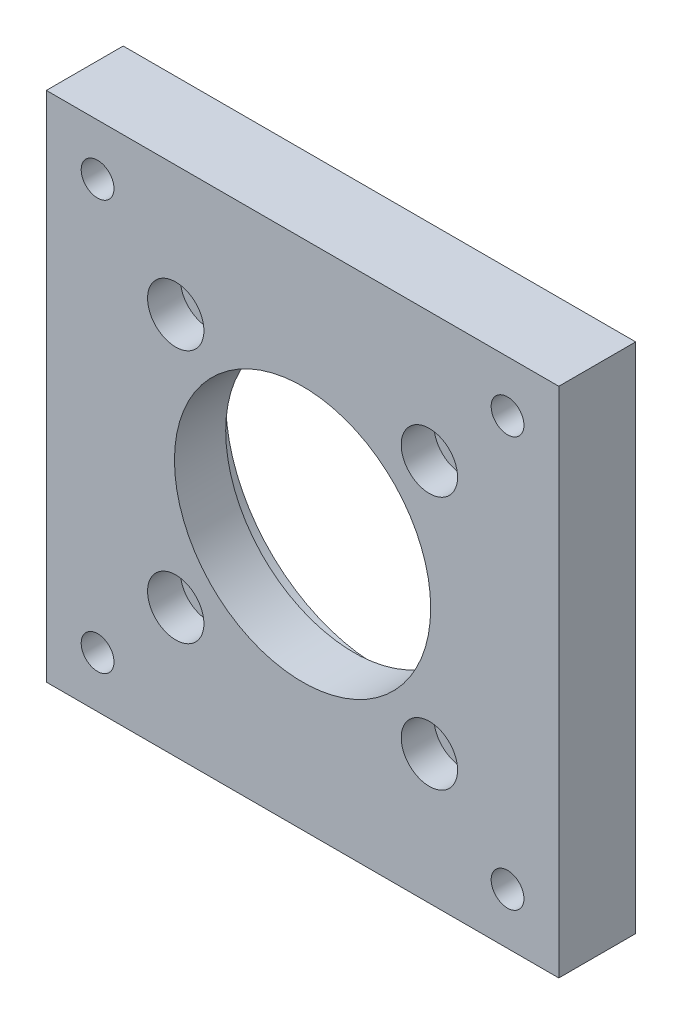
ISO-10303-21;
HEADER;
FILE_DESCRIPTION(('STEP AP214'),'2;1');
FILE_NAME('part.step','',(''),(''),'','','');
FILE_SCHEMA(('AUTOMOTIVE_DESIGN { 1 0 10303 214 1 1 1 1 }'));
ENDSEC;
DATA;
#1=APPLICATION_CONTEXT('core data for automotive mechanical design processes');
#2=APPLICATION_PROTOCOL_DEFINITION('international standard','automotive_design',2000,#1);
#3=PRODUCT_CONTEXT('',#1,'mechanical');
#4=PRODUCT('Part','Part','',(#3));
#5=PRODUCT_RELATED_PRODUCT_CATEGORY('part','',(#4));
#6=PRODUCT_DEFINITION_FORMATION('','',#4);
#7=PRODUCT_DEFINITION_CONTEXT('part definition',#1,'design');
#8=PRODUCT_DEFINITION('design','',#6,#7);
#9=PRODUCT_DEFINITION_SHAPE('','',#8);
#10=(LENGTH_UNIT() NAMED_UNIT(*) SI_UNIT(.MILLI.,.METRE.));
#11=(NAMED_UNIT(*) PLANE_ANGLE_UNIT() SI_UNIT($,.RADIAN.));
#12=(NAMED_UNIT(*) SI_UNIT($,.STERADIAN.) SOLID_ANGLE_UNIT());
#13=UNCERTAINTY_MEASURE_WITH_UNIT(LENGTH_MEASURE(1.E-05),#10,'distance_accuracy_value','');
#14=(GEOMETRIC_REPRESENTATION_CONTEXT(3) GLOBAL_UNCERTAINTY_ASSIGNED_CONTEXT((#13)) GLOBAL_UNIT_ASSIGNED_CONTEXT((#10,
#11,#12)) REPRESENTATION_CONTEXT('',''));
#15=CARTESIAN_POINT('',(0.,0.,0.));
#16=DIRECTION('',(0.,0.,1.));
#17=DIRECTION('',(1.,0.,0.));
#18=AXIS2_PLACEMENT_3D('',#15,#16,#17);
#19=CARTESIAN_POINT('',(0.,0.,0.));
#20=DIRECTION('',(0.,0.,1.));
#21=DIRECTION('',(1.,0.,0.));
#22=AXIS2_PLACEMENT_3D('',#19,#20,#21);
#23=PLANE('',#22);
#24=CARTESIAN_POINT('',(-24.7487373415292,24.7487373415292,0.));
#25=DIRECTION('',(0.,0.,1.));
#26=DIRECTION('',(1.,0.,0.));
#27=AXIS2_PLACEMENT_3D('',#24,#25,#26);
#28=CIRCLE('',#27,3.19999999999999);
#29=CARTESIAN_POINT('',(-21.5487373415292,24.7487373415292,0.));
#30=VERTEX_POINT('',#29);
#31=EDGE_CURVE('E201',#30,#30,#28,.T.);
#32=ORIENTED_EDGE('',*,*,#31,.T.);
#33=EDGE_LOOP('',(#32));
#34=FACE_BOUND('',#33,.T.);
#35=CARTESIAN_POINT('',(-24.7487373415292,-24.7487373415292,0.));
#36=DIRECTION('',(0.,0.,1.));
#37=DIRECTION('',(1.,0.,0.));
#38=AXIS2_PLACEMENT_3D('',#35,#36,#37);
#39=CIRCLE('',#38,3.19999999999999);
#40=CARTESIAN_POINT('',(-21.5487373415292,-24.7487373415292,0.));
#41=VERTEX_POINT('',#40);
#42=EDGE_CURVE('E189',#41,#41,#39,.T.);
#43=ORIENTED_EDGE('',*,*,#42,.T.);
#44=EDGE_LOOP('',(#43));
#45=FACE_BOUND('',#44,.T.);
#46=CARTESIAN_POINT('',(24.7487373415292,-24.7487373415292,0.));
#47=DIRECTION('',(0.,0.,1.));
#48=DIRECTION('',(1.,0.,0.));
#49=AXIS2_PLACEMENT_3D('',#46,#47,#48);
#50=CIRCLE('',#49,3.2);
#51=CARTESIAN_POINT('',(27.9487373415292,-24.7487373415292,0.));
#52=VERTEX_POINT('',#51);
#53=EDGE_CURVE('E177',#52,#52,#50,.T.);
#54=ORIENTED_EDGE('',*,*,#53,.T.);
#55=EDGE_LOOP('',(#54));
#56=FACE_BOUND('',#55,.T.);
#57=CARTESIAN_POINT('',(24.7487373415292,24.7487373415292,0.));
#58=DIRECTION('',(0.,0.,1.));
#59=DIRECTION('',(1.,0.,0.));
#60=AXIS2_PLACEMENT_3D('',#57,#58,#59);
#61=CIRCLE('',#60,3.2);
#62=CARTESIAN_POINT('',(27.9487373415292,24.7487373415292,0.));
#63=VERTEX_POINT('',#62);
#64=EDGE_CURVE('E163',#63,#63,#61,.T.);
#65=ORIENTED_EDGE('',*,*,#64,.T.);
#66=EDGE_LOOP('',(#65));
#67=FACE_BOUND('',#66,.T.);
#68=DIRECTION('',(0.,-1.,0.));
#69=VECTOR('',#68,1.);
#70=CARTESIAN_POINT('',(-50.,-50.,0.));
#71=LINE('',#70,#69);
#72=CARTESIAN_POINT('',(-50.,50.,0.));
#73=VERTEX_POINT('',#72);
#74=CARTESIAN_POINT('',(-50.,-50.,0.));
#75=VERTEX_POINT('',#74);
#76=EDGE_CURVE('E98',#73,#75,#71,.T.);
#77=ORIENTED_EDGE('',*,*,#76,.F.);
#78=DIRECTION('',(-1.,0.,0.));
#79=VECTOR('',#78,1.);
#80=CARTESIAN_POINT('',(50.,50.,0.));
#81=LINE('',#80,#79);
#82=CARTESIAN_POINT('',(50.,50.,0.));
#83=VERTEX_POINT('',#82);
#84=EDGE_CURVE('E74',#83,#73,#81,.T.);
#85=ORIENTED_EDGE('',*,*,#84,.F.);
#86=DIRECTION('',(0.,1.,0.));
#87=VECTOR('',#86,1.);
#88=CARTESIAN_POINT('',(50.,-50.,0.));
#89=LINE('',#88,#87);
#90=CARTESIAN_POINT('',(50.,-50.,0.));
#91=VERTEX_POINT('',#90);
#92=EDGE_CURVE('E68',#91,#83,#89,.T.);
#93=ORIENTED_EDGE('',*,*,#92,.F.);
#94=DIRECTION('',(1.,0.,0.));
#95=VECTOR('',#94,1.);
#96=CARTESIAN_POINT('',(50.,-50.,0.));
#97=LINE('',#96,#95);
#98=EDGE_CURVE('E90',#75,#91,#97,.T.);
#99=ORIENTED_EDGE('',*,*,#98,.F.);
#100=EDGE_LOOP('',(#77,#85,#93,#99));
#101=FACE_BOUND('',#100,.T.);
#102=CARTESIAN_POINT('',(-40.,-40.,0.));
#103=DIRECTION('',(0.,0.,-1.));
#104=DIRECTION('',(-1.,0.,0.));
#105=AXIS2_PLACEMENT_3D('',#102,#103,#104);
#106=CIRCLE('',#105,5.5);
#107=CARTESIAN_POINT('',(-45.5,-40.,0.));
#108=VERTEX_POINT('',#107);
#109=EDGE_CURVE('E120',#108,#108,#106,.T.);
#110=ORIENTED_EDGE('',*,*,#109,.F.);
#111=EDGE_LOOP('',(#110));
#112=FACE_BOUND('',#111,.T.);
#113=CARTESIAN_POINT('',(40.,-40.,0.));
#114=DIRECTION('',(0.,0.,-1.));
#115=DIRECTION('',(-1.,0.,0.));
#116=AXIS2_PLACEMENT_3D('',#113,#114,#115);
#117=CIRCLE('',#116,5.5);
#118=CARTESIAN_POINT('',(34.5,-40.,0.));
#119=VERTEX_POINT('',#118);
#120=EDGE_CURVE('E132',#119,#119,#117,.T.);
#121=ORIENTED_EDGE('',*,*,#120,.F.);
#122=EDGE_LOOP('',(#121));
#123=FACE_BOUND('',#122,.T.);
#124=CARTESIAN_POINT('',(40.,40.,0.));
#125=DIRECTION('',(0.,0.,-1.));
#126=DIRECTION('',(-1.,0.,0.));
#127=AXIS2_PLACEMENT_3D('',#124,#125,#126);
#128=CIRCLE('',#127,5.5);
#129=CARTESIAN_POINT('',(34.5,40.,0.));
#130=VERTEX_POINT('',#129);
#131=EDGE_CURVE('E144',#130,#130,#128,.T.);
#132=ORIENTED_EDGE('',*,*,#131,.F.);
#133=EDGE_LOOP('',(#132));
#134=FACE_BOUND('',#133,.T.);
#135=CARTESIAN_POINT('',(-40.,40.,0.));
#136=DIRECTION('',(0.,0.,-1.));
#137=DIRECTION('',(-1.,0.,0.));
#138=AXIS2_PLACEMENT_3D('',#135,#136,#137);
#139=CIRCLE('',#138,5.5);
#140=CARTESIAN_POINT('',(-45.5,40.,0.));
#141=VERTEX_POINT('',#140);
#142=EDGE_CURVE('E156',#141,#141,#139,.T.);
#143=ORIENTED_EDGE('',*,*,#142,.F.);
#144=EDGE_LOOP('',(#143));
#145=FACE_BOUND('',#144,.T.);
#146=CARTESIAN_POINT('',(0.,0.,0.));
#147=DIRECTION('',(0.,0.,1.));
#148=DIRECTION('',(1.,0.,0.));
#149=AXIS2_PLACEMENT_3D('',#146,#147,#148);
#150=CIRCLE('',#149,30.);
#151=CARTESIAN_POINT('',(30.,0.,0.));
#152=VERTEX_POINT('',#151);
#153=EDGE_CURVE('E160',#152,#152,#150,.T.);
#154=ORIENTED_EDGE('',*,*,#153,.T.);
#155=EDGE_LOOP('',(#154));
#156=FACE_BOUND('',#155,.T.);
#157=ADVANCED_FACE('F34',(#34,#45,#56,#67,#101,#112,#123,#134,#145,#156),#23,.F.);
#158=CARTESIAN_POINT('',(-50.,-50.,15.));
#159=DIRECTION('',(1.,0.,0.));
#160=DIRECTION('',(0.,0.,-1.));
#161=AXIS2_PLACEMENT_3D('',#158,#159,#160);
#162=PLANE('',#161);
#163=ORIENTED_EDGE('',*,*,#76,.T.);
#164=DIRECTION('',(0.,0.,-1.));
#165=VECTOR('',#164,1.);
#166=CARTESIAN_POINT('',(-50.,-50.,15.));
#167=LINE('',#166,#165);
#168=CARTESIAN_POINT('',(-50.,-50.,15.));
#169=VERTEX_POINT('',#168);
#170=EDGE_CURVE('E11',#169,#75,#167,.T.);
#171=ORIENTED_EDGE('',*,*,#170,.F.);
#172=DIRECTION('',(0.,-1.,0.));
#173=VECTOR('',#172,1.);
#174=CARTESIAN_POINT('',(-50.,-50.,15.));
#175=LINE('',#174,#173);
#176=CARTESIAN_POINT('',(-50.,50.,15.));
#177=VERTEX_POINT('',#176);
#178=EDGE_CURVE('E86',#177,#169,#175,.T.);
#179=ORIENTED_EDGE('',*,*,#178,.F.);
#180=DIRECTION('',(0.,0.,-1.));
#181=VECTOR('',#180,1.);
#182=CARTESIAN_POINT('',(-50.,50.,15.));
#183=LINE('',#182,#181);
#184=EDGE_CURVE('E94',#177,#73,#183,.T.);
#185=ORIENTED_EDGE('',*,*,#184,.T.);
#186=EDGE_LOOP('',(#163,#171,#179,#185));
#187=FACE_BOUND('',#186,.T.);
#188=ADVANCED_FACE('F36',(#187),#162,.F.);
#189=CARTESIAN_POINT('',(50.,-50.,15.));
#190=DIRECTION('',(0.,1.,0.));
#191=DIRECTION('',(-1.,0.,0.));
#192=AXIS2_PLACEMENT_3D('',#189,#190,#191);
#193=PLANE('',#192);
#194=ORIENTED_EDGE('',*,*,#98,.T.);
#195=DIRECTION('',(0.,0.,-1.));
#196=VECTOR('',#195,1.);
#197=CARTESIAN_POINT('',(50.,-50.,15.));
#198=LINE('',#197,#196);
#199=CARTESIAN_POINT('',(50.,-50.,15.));
#200=VERTEX_POINT('',#199);
#201=EDGE_CURVE('E43',#200,#91,#198,.T.);
#202=ORIENTED_EDGE('',*,*,#201,.F.);
#203=DIRECTION('',(1.,0.,0.));
#204=VECTOR('',#203,1.);
#205=CARTESIAN_POINT('',(50.,-50.,15.));
#206=LINE('',#205,#204);
#207=EDGE_CURVE('E81',#169,#200,#206,.T.);
#208=ORIENTED_EDGE('',*,*,#207,.F.);
#209=ORIENTED_EDGE('',*,*,#170,.T.);
#210=EDGE_LOOP('',(#194,#202,#208,#209));
#211=FACE_BOUND('',#210,.T.);
#212=ADVANCED_FACE('F89',(#211),#193,.F.);
#213=CARTESIAN_POINT('',(50.,-50.,15.));
#214=DIRECTION('',(-1.,0.,0.));
#215=DIRECTION('',(0.,0.,1.));
#216=AXIS2_PLACEMENT_3D('',#213,#214,#215);
#217=PLANE('',#216);
#218=ORIENTED_EDGE('',*,*,#92,.T.);
#219=DIRECTION('',(0.,0.,-1.));
#220=VECTOR('',#219,1.);
#221=CARTESIAN_POINT('',(50.,50.,15.));
#222=LINE('',#221,#220);
#223=CARTESIAN_POINT('',(50.,50.,15.));
#224=VERTEX_POINT('',#223);
#225=EDGE_CURVE('E91',#224,#83,#222,.T.);
#226=ORIENTED_EDGE('',*,*,#225,.F.);
#227=DIRECTION('',(0.,1.,0.));
#228=VECTOR('',#227,1.);
#229=CARTESIAN_POINT('',(50.,-50.,15.));
#230=LINE('',#229,#228);
#231=EDGE_CURVE('E84',#200,#224,#230,.T.);
#232=ORIENTED_EDGE('',*,*,#231,.F.);
#233=ORIENTED_EDGE('',*,*,#201,.T.);
#234=EDGE_LOOP('',(#218,#226,#232,#233));
#235=FACE_BOUND('',#234,.T.);
#236=ADVANCED_FACE('F92',(#235),#217,.F.);
#237=CARTESIAN_POINT('',(50.,50.,15.));
#238=DIRECTION('',(0.,-1.,0.));
#239=DIRECTION('',(1.,0.,0.));
#240=AXIS2_PLACEMENT_3D('',#237,#238,#239);
#241=PLANE('',#240);
#242=ORIENTED_EDGE('',*,*,#84,.T.);
#243=ORIENTED_EDGE('',*,*,#184,.F.);
#244=DIRECTION('',(-1.,0.,0.));
#245=VECTOR('',#244,1.);
#246=CARTESIAN_POINT('',(50.,50.,15.));
#247=LINE('',#246,#245);
#248=EDGE_CURVE('E51',#224,#177,#247,.T.);
#249=ORIENTED_EDGE('',*,*,#248,.F.);
#250=ORIENTED_EDGE('',*,*,#225,.T.);
#251=EDGE_LOOP('',(#242,#243,#249,#250));
#252=FACE_BOUND('',#251,.T.);
#253=ADVANCED_FACE('F106',(#252),#241,.F.);
#254=CARTESIAN_POINT('',(0.,0.,15.));
#255=DIRECTION('',(0.,0.,1.));
#256=DIRECTION('',(1.,0.,0.));
#257=AXIS2_PLACEMENT_3D('',#254,#255,#256);
#258=PLANE('',#257);
#259=CARTESIAN_POINT('',(0.,0.,15.));
#260=DIRECTION('',(0.,0.,-1.));
#261=DIRECTION('',(-1.,0.,0.));
#262=AXIS2_PLACEMENT_3D('',#259,#260,#261);
#263=CIRCLE('',#262,25.);
#264=CARTESIAN_POINT('',(-25.,0.,15.));
#265=VERTEX_POINT('',#264);
#266=EDGE_CURVE('E213',#265,#265,#263,.T.);
#267=ORIENTED_EDGE('',*,*,#266,.T.);
#268=EDGE_LOOP('',(#267));
#269=FACE_BOUND('',#268,.T.);
#270=CARTESIAN_POINT('',(-24.7487373415292,24.7487373415292,15.));
#271=DIRECTION('',(0.,0.,1.));
#272=DIRECTION('',(1.,0.,0.));
#273=AXIS2_PLACEMENT_3D('',#270,#271,#272);
#274=CIRCLE('',#273,5.49999999999999);
#275=CARTESIAN_POINT('',(-19.2487373415292,24.7487373415292,15.));
#276=VERTEX_POINT('',#275);
#277=EDGE_CURVE('E210',#276,#276,#274,.T.);
#278=ORIENTED_EDGE('',*,*,#277,.F.);
#279=EDGE_LOOP('',(#278));
#280=FACE_BOUND('',#279,.T.);
#281=CARTESIAN_POINT('',(-24.7487373415292,-24.7487373415292,15.));
#282=DIRECTION('',(0.,0.,1.));
#283=DIRECTION('',(1.,0.,0.));
#284=AXIS2_PLACEMENT_3D('',#281,#282,#283);
#285=CIRCLE('',#284,5.49999999999999);
#286=CARTESIAN_POINT('',(-19.2487373415292,-24.7487373415292,15.));
#287=VERTEX_POINT('',#286);
#288=EDGE_CURVE('E198',#287,#287,#285,.T.);
#289=ORIENTED_EDGE('',*,*,#288,.F.);
#290=EDGE_LOOP('',(#289));
#291=FACE_BOUND('',#290,.T.);
#292=CARTESIAN_POINT('',(24.7487373415292,-24.7487373415292,15.));
#293=DIRECTION('',(0.,0.,1.));
#294=DIRECTION('',(1.,0.,0.));
#295=AXIS2_PLACEMENT_3D('',#292,#293,#294);
#296=CIRCLE('',#295,5.49999999999999);
#297=CARTESIAN_POINT('',(30.2487373415292,-24.7487373415292,15.));
#298=VERTEX_POINT('',#297);
#299=EDGE_CURVE('E186',#298,#298,#296,.T.);
#300=ORIENTED_EDGE('',*,*,#299,.F.);
#301=EDGE_LOOP('',(#300));
#302=FACE_BOUND('',#301,.T.);
#303=CARTESIAN_POINT('',(24.7487373415292,24.7487373415292,15.));
#304=DIRECTION('',(0.,0.,1.));
#305=DIRECTION('',(1.,0.,0.));
#306=AXIS2_PLACEMENT_3D('',#303,#304,#305);
#307=CIRCLE('',#306,5.49999999999999);
#308=CARTESIAN_POINT('',(30.2487373415292,24.7487373415292,15.));
#309=VERTEX_POINT('',#308);
#310=EDGE_CURVE('E174',#309,#309,#307,.T.);
#311=ORIENTED_EDGE('',*,*,#310,.F.);
#312=EDGE_LOOP('',(#311));
#313=FACE_BOUND('',#312,.T.);
#314=CARTESIAN_POINT('',(-40.,40.,15.));
#315=DIRECTION('',(0.,0.,-1.));
#316=DIRECTION('',(-1.,0.,0.));
#317=AXIS2_PLACEMENT_3D('',#314,#315,#316);
#318=CIRCLE('',#317,3.19999999999999);
#319=CARTESIAN_POINT('',(-43.2,40.,15.));
#320=VERTEX_POINT('',#319);
#321=EDGE_CURVE('E147',#320,#320,#318,.T.);
#322=ORIENTED_EDGE('',*,*,#321,.T.);
#323=EDGE_LOOP('',(#322));
#324=FACE_BOUND('',#323,.T.);
#325=CARTESIAN_POINT('',(40.,40.,15.));
#326=DIRECTION('',(0.,0.,-1.));
#327=DIRECTION('',(-1.,0.,0.));
#328=AXIS2_PLACEMENT_3D('',#325,#326,#327);
#329=CIRCLE('',#328,3.19999999999999);
#330=CARTESIAN_POINT('',(36.8,40.,15.));
#331=VERTEX_POINT('',#330);
#332=EDGE_CURVE('E135',#331,#331,#329,.T.);
#333=ORIENTED_EDGE('',*,*,#332,.T.);
#334=EDGE_LOOP('',(#333));
#335=FACE_BOUND('',#334,.T.);
#336=CARTESIAN_POINT('',(40.,-40.,15.));
#337=DIRECTION('',(0.,0.,-1.));
#338=DIRECTION('',(-1.,0.,0.));
#339=AXIS2_PLACEMENT_3D('',#336,#337,#338);
#340=CIRCLE('',#339,3.19999999999999);
#341=CARTESIAN_POINT('',(36.8,-40.,15.));
#342=VERTEX_POINT('',#341);
#343=EDGE_CURVE('E123',#342,#342,#340,.T.);
#344=ORIENTED_EDGE('',*,*,#343,.T.);
#345=EDGE_LOOP('',(#344));
#346=FACE_BOUND('',#345,.T.);
#347=CARTESIAN_POINT('',(-40.,-40.,15.));
#348=DIRECTION('',(0.,0.,-1.));
#349=DIRECTION('',(-1.,0.,0.));
#350=AXIS2_PLACEMENT_3D('',#347,#348,#349);
#351=CIRCLE('',#350,3.19999999999999);
#352=CARTESIAN_POINT('',(-43.2,-40.,15.));
#353=VERTEX_POINT('',#352);
#354=EDGE_CURVE('E101',#353,#353,#351,.T.);
#355=ORIENTED_EDGE('',*,*,#354,.T.);
#356=EDGE_LOOP('',(#355));
#357=FACE_BOUND('',#356,.T.);
#358=ORIENTED_EDGE('',*,*,#178,.T.);
#359=ORIENTED_EDGE('',*,*,#207,.T.);
#360=ORIENTED_EDGE('',*,*,#231,.T.);
#361=ORIENTED_EDGE('',*,*,#248,.T.);
#362=EDGE_LOOP('',(#358,#359,#360,#361));
#363=FACE_BOUND('',#362,.T.);
#364=ADVANCED_FACE('F82',(#269,#280,#291,#302,#313,#324,#335,#346,#357,#363),#258,.T.);
#365=CARTESIAN_POINT('',(-40.,-40.,0.));
#366=DIRECTION('',(0.,0.,-1.));
#367=DIRECTION('',(-1.,0.,0.));
#368=AXIS2_PLACEMENT_3D('',#365,#366,#367);
#369=CYLINDRICAL_SURFACE('',#368,3.2);
#370=ORIENTED_EDGE('',*,*,#354,.F.);
#371=EDGE_LOOP('',(#370));
#372=FACE_BOUND('',#371,.T.);
#373=CARTESIAN_POINT('',(-40.,-40.,6.4));
#374=DIRECTION('',(0.,0.,-1.));
#375=DIRECTION('',(-1.,0.,0.));
#376=AXIS2_PLACEMENT_3D('',#373,#374,#375);
#377=CIRCLE('',#376,3.2);
#378=CARTESIAN_POINT('',(-43.2,-40.,6.4));
#379=VERTEX_POINT('',#378);
#380=EDGE_CURVE('E114',#379,#379,#377,.T.);
#381=ORIENTED_EDGE('',*,*,#380,.T.);
#382=EDGE_LOOP('',(#381));
#383=FACE_BOUND('',#382,.T.);
#384=ADVANCED_FACE('F276',(#372,#383),#369,.F.);
#385=CARTESIAN_POINT('',(-36.8,-40.,6.4));
#386=DIRECTION('',(0.,0.,1.));
#387=DIRECTION('',(1.,0.,0.));
#388=AXIS2_PLACEMENT_3D('',#385,#386,#387);
#389=PLANE('',#388);
#390=ORIENTED_EDGE('',*,*,#380,.F.);
#391=EDGE_LOOP('',(#390));
#392=FACE_BOUND('',#391,.T.);
#393=CARTESIAN_POINT('',(-40.,-40.,6.4));
#394=DIRECTION('',(0.,0.,-1.));
#395=DIRECTION('',(-1.,0.,0.));
#396=AXIS2_PLACEMENT_3D('',#393,#394,#395);
#397=CIRCLE('',#396,5.5);
#398=CARTESIAN_POINT('',(-45.5,-40.,6.4));
#399=VERTEX_POINT('',#398);
#400=EDGE_CURVE('E117',#399,#399,#397,.T.);
#401=ORIENTED_EDGE('',*,*,#400,.T.);
#402=EDGE_LOOP('',(#401));
#403=FACE_BOUND('',#402,.T.);
#404=ADVANCED_FACE('F283',(#392,#403),#389,.F.);
#405=CARTESIAN_POINT('',(-40.,-40.,0.));
#406=DIRECTION('',(0.,0.,-1.));
#407=DIRECTION('',(-1.,0.,0.));
#408=AXIS2_PLACEMENT_3D('',#405,#406,#407);
#409=CYLINDRICAL_SURFACE('',#408,5.5);
#410=ORIENTED_EDGE('',*,*,#400,.F.);
#411=EDGE_LOOP('',(#410));
#412=FACE_BOUND('',#411,.T.);
#413=ORIENTED_EDGE('',*,*,#109,.T.);
#414=EDGE_LOOP('',(#413));
#415=FACE_BOUND('',#414,.T.);
#416=ADVANCED_FACE('F290',(#412,#415),#409,.F.);
#417=CARTESIAN_POINT('',(40.,-40.,0.));
#418=DIRECTION('',(0.,0.,-1.));
#419=DIRECTION('',(-1.,0.,0.));
#420=AXIS2_PLACEMENT_3D('',#417,#418,#419);
#421=CYLINDRICAL_SURFACE('',#420,3.2);
#422=ORIENTED_EDGE('',*,*,#343,.F.);
#423=EDGE_LOOP('',(#422));
#424=FACE_BOUND('',#423,.T.);
#425=CARTESIAN_POINT('',(40.,-40.,6.4));
#426=DIRECTION('',(0.,0.,-1.));
#427=DIRECTION('',(-1.,0.,0.));
#428=AXIS2_PLACEMENT_3D('',#425,#426,#427);
#429=CIRCLE('',#428,3.2);
#430=CARTESIAN_POINT('',(36.8,-40.,6.4));
#431=VERTEX_POINT('',#430);
#432=EDGE_CURVE('E126',#431,#431,#429,.T.);
#433=ORIENTED_EDGE('',*,*,#432,.T.);
#434=EDGE_LOOP('',(#433));
#435=FACE_BOUND('',#434,.T.);
#436=ADVANCED_FACE('F298',(#424,#435),#421,.F.);
#437=CARTESIAN_POINT('',(43.2,-40.,6.4));
#438=DIRECTION('',(0.,0.,1.));
#439=DIRECTION('',(1.,0.,0.));
#440=AXIS2_PLACEMENT_3D('',#437,#438,#439);
#441=PLANE('',#440);
#442=ORIENTED_EDGE('',*,*,#432,.F.);
#443=EDGE_LOOP('',(#442));
#444=FACE_BOUND('',#443,.T.);
#445=CARTESIAN_POINT('',(40.,-40.,6.4));
#446=DIRECTION('',(0.,0.,-1.));
#447=DIRECTION('',(-1.,0.,0.));
#448=AXIS2_PLACEMENT_3D('',#445,#446,#447);
#449=CIRCLE('',#448,5.5);
#450=CARTESIAN_POINT('',(34.5,-40.,6.4));
#451=VERTEX_POINT('',#450);
#452=EDGE_CURVE('E129',#451,#451,#449,.T.);
#453=ORIENTED_EDGE('',*,*,#452,.T.);
#454=EDGE_LOOP('',(#453));
#455=FACE_BOUND('',#454,.T.);
#456=ADVANCED_FACE('F306',(#444,#455),#441,.F.);
#457=CARTESIAN_POINT('',(40.,-40.,0.));
#458=DIRECTION('',(0.,0.,-1.));
#459=DIRECTION('',(-1.,0.,0.));
#460=AXIS2_PLACEMENT_3D('',#457,#458,#459);
#461=CYLINDRICAL_SURFACE('',#460,5.5);
#462=ORIENTED_EDGE('',*,*,#452,.F.);
#463=EDGE_LOOP('',(#462));
#464=FACE_BOUND('',#463,.T.);
#465=ORIENTED_EDGE('',*,*,#120,.T.);
#466=EDGE_LOOP('',(#465));
#467=FACE_BOUND('',#466,.T.);
#468=ADVANCED_FACE('F314',(#464,#467),#461,.F.);
#469=CARTESIAN_POINT('',(40.,40.,0.));
#470=DIRECTION('',(0.,0.,-1.));
#471=DIRECTION('',(-1.,0.,0.));
#472=AXIS2_PLACEMENT_3D('',#469,#470,#471);
#473=CYLINDRICAL_SURFACE('',#472,3.2);
#474=ORIENTED_EDGE('',*,*,#332,.F.);
#475=EDGE_LOOP('',(#474));
#476=FACE_BOUND('',#475,.T.);
#477=CARTESIAN_POINT('',(40.,40.,6.4));
#478=DIRECTION('',(0.,0.,-1.));
#479=DIRECTION('',(-1.,0.,0.));
#480=AXIS2_PLACEMENT_3D('',#477,#478,#479);
#481=CIRCLE('',#480,3.2);
#482=CARTESIAN_POINT('',(36.8,40.,6.4));
#483=VERTEX_POINT('',#482);
#484=EDGE_CURVE('E138',#483,#483,#481,.T.);
#485=ORIENTED_EDGE('',*,*,#484,.T.);
#486=EDGE_LOOP('',(#485));
#487=FACE_BOUND('',#486,.T.);
#488=ADVANCED_FACE('F322',(#476,#487),#473,.F.);
#489=CARTESIAN_POINT('',(43.2,40.,6.4));
#490=DIRECTION('',(0.,0.,1.));
#491=DIRECTION('',(1.,0.,0.));
#492=AXIS2_PLACEMENT_3D('',#489,#490,#491);
#493=PLANE('',#492);
#494=ORIENTED_EDGE('',*,*,#484,.F.);
#495=EDGE_LOOP('',(#494));
#496=FACE_BOUND('',#495,.T.);
#497=CARTESIAN_POINT('',(40.,40.,6.4));
#498=DIRECTION('',(0.,0.,-1.));
#499=DIRECTION('',(-1.,0.,0.));
#500=AXIS2_PLACEMENT_3D('',#497,#498,#499);
#501=CIRCLE('',#500,5.5);
#502=CARTESIAN_POINT('',(34.5,40.,6.4));
#503=VERTEX_POINT('',#502);
#504=EDGE_CURVE('E141',#503,#503,#501,.T.);
#505=ORIENTED_EDGE('',*,*,#504,.T.);
#506=EDGE_LOOP('',(#505));
#507=FACE_BOUND('',#506,.T.);
#508=ADVANCED_FACE('F330',(#496,#507),#493,.F.);
#509=CARTESIAN_POINT('',(40.,40.,0.));
#510=DIRECTION('',(0.,0.,-1.));
#511=DIRECTION('',(-1.,0.,0.));
#512=AXIS2_PLACEMENT_3D('',#509,#510,#511);
#513=CYLINDRICAL_SURFACE('',#512,5.5);
#514=ORIENTED_EDGE('',*,*,#504,.F.);
#515=EDGE_LOOP('',(#514));
#516=FACE_BOUND('',#515,.T.);
#517=ORIENTED_EDGE('',*,*,#131,.T.);
#518=EDGE_LOOP('',(#517));
#519=FACE_BOUND('',#518,.T.);
#520=ADVANCED_FACE('F338',(#516,#519),#513,.F.);
#521=CARTESIAN_POINT('',(-40.,40.,0.));
#522=DIRECTION('',(0.,0.,-1.));
#523=DIRECTION('',(-1.,0.,0.));
#524=AXIS2_PLACEMENT_3D('',#521,#522,#523);
#525=CYLINDRICAL_SURFACE('',#524,3.2);
#526=ORIENTED_EDGE('',*,*,#321,.F.);
#527=EDGE_LOOP('',(#526));
#528=FACE_BOUND('',#527,.T.);
#529=CARTESIAN_POINT('',(-40.,40.,6.4));
#530=DIRECTION('',(0.,0.,-1.));
#531=DIRECTION('',(-1.,0.,0.));
#532=AXIS2_PLACEMENT_3D('',#529,#530,#531);
#533=CIRCLE('',#532,3.2);
#534=CARTESIAN_POINT('',(-43.2,40.,6.4));
#535=VERTEX_POINT('',#534);
#536=EDGE_CURVE('E150',#535,#535,#533,.T.);
#537=ORIENTED_EDGE('',*,*,#536,.T.);
#538=EDGE_LOOP('',(#537));
#539=FACE_BOUND('',#538,.T.);
#540=ADVANCED_FACE('F346',(#528,#539),#525,.F.);
#541=CARTESIAN_POINT('',(-36.8,40.,6.4));
#542=DIRECTION('',(0.,0.,1.));
#543=DIRECTION('',(1.,0.,0.));
#544=AXIS2_PLACEMENT_3D('',#541,#542,#543);
#545=PLANE('',#544);
#546=ORIENTED_EDGE('',*,*,#536,.F.);
#547=EDGE_LOOP('',(#546));
#548=FACE_BOUND('',#547,.T.);
#549=CARTESIAN_POINT('',(-40.,40.,6.4));
#550=DIRECTION('',(0.,0.,-1.));
#551=DIRECTION('',(-1.,0.,0.));
#552=AXIS2_PLACEMENT_3D('',#549,#550,#551);
#553=CIRCLE('',#552,5.5);
#554=CARTESIAN_POINT('',(-45.5,40.,6.4));
#555=VERTEX_POINT('',#554);
#556=EDGE_CURVE('E153',#555,#555,#553,.T.);
#557=ORIENTED_EDGE('',*,*,#556,.T.);
#558=EDGE_LOOP('',(#557));
#559=FACE_BOUND('',#558,.T.);
#560=ADVANCED_FACE('F354',(#548,#559),#545,.F.);
#561=CARTESIAN_POINT('',(-40.,40.,0.));
#562=DIRECTION('',(0.,0.,-1.));
#563=DIRECTION('',(-1.,0.,0.));
#564=AXIS2_PLACEMENT_3D('',#561,#562,#563);
#565=CYLINDRICAL_SURFACE('',#564,5.5);
#566=ORIENTED_EDGE('',*,*,#556,.F.);
#567=EDGE_LOOP('',(#566));
#568=FACE_BOUND('',#567,.T.);
#569=ORIENTED_EDGE('',*,*,#142,.T.);
#570=EDGE_LOOP('',(#569));
#571=FACE_BOUND('',#570,.T.);
#572=ADVANCED_FACE('F239',(#568,#571),#565,.F.);
#573=CARTESIAN_POINT('',(0.,0.,5.));
#574=DIRECTION('',(0.,0.,-1.));
#575=DIRECTION('',(-1.,0.,0.));
#576=AXIS2_PLACEMENT_3D('',#573,#574,#575);
#577=CYLINDRICAL_SURFACE('',#576,30.);
#578=CARTESIAN_POINT('',(0.,0.,5.));
#579=DIRECTION('',(0.,0.,1.));
#580=DIRECTION('',(1.,0.,0.));
#581=AXIS2_PLACEMENT_3D('',#578,#579,#580);
#582=CIRCLE('',#581,30.);
#583=CARTESIAN_POINT('',(30.,0.,5.));
#584=VERTEX_POINT('',#583);
#585=EDGE_CURVE('E159',#584,#584,#582,.T.);
#586=ORIENTED_EDGE('',*,*,#585,.T.);
#587=EDGE_LOOP('',(#586));
#588=FACE_BOUND('',#587,.T.);
#589=ORIENTED_EDGE('',*,*,#153,.F.);
#590=EDGE_LOOP('',(#589));
#591=FACE_BOUND('',#590,.T.);
#592=ADVANCED_FACE('F233',(#588,#591),#577,.F.);
#593=CARTESIAN_POINT('',(0.,0.,5.));
#594=DIRECTION('',(0.,0.,1.));
#595=DIRECTION('',(1.,0.,0.));
#596=AXIS2_PLACEMENT_3D('',#593,#594,#595);
#597=PLANE('',#596);
#598=CARTESIAN_POINT('',(0.,0.,5.));
#599=DIRECTION('',(0.,0.,-1.));
#600=DIRECTION('',(-1.,0.,0.));
#601=AXIS2_PLACEMENT_3D('',#598,#599,#600);
#602=CIRCLE('',#601,25.);
#603=CARTESIAN_POINT('',(-25.,0.,5.));
#604=VERTEX_POINT('',#603);
#605=EDGE_CURVE('E214',#604,#604,#602,.T.);
#606=ORIENTED_EDGE('',*,*,#605,.F.);
#607=EDGE_LOOP('',(#606));
#608=FACE_BOUND('',#607,.T.);
#609=ORIENTED_EDGE('',*,*,#585,.F.);
#610=EDGE_LOOP('',(#609));
#611=FACE_BOUND('',#610,.T.);
#612=ADVANCED_FACE('F229',(#608,#611),#597,.F.);
#613=CARTESIAN_POINT('',(24.7487373415292,24.7487373415292,15.));
#614=DIRECTION('',(0.,0.,1.));
#615=DIRECTION('',(1.,0.,0.));
#616=AXIS2_PLACEMENT_3D('',#613,#614,#615);
#617=CYLINDRICAL_SURFACE('',#616,3.20000000000001);
#618=ORIENTED_EDGE('',*,*,#64,.F.);
#619=EDGE_LOOP('',(#618));
#620=FACE_BOUND('',#619,.T.);
#621=CARTESIAN_POINT('',(24.7487373415292,24.7487373415292,8.6));
#622=DIRECTION('',(0.,0.,1.));
#623=DIRECTION('',(1.,0.,0.));
#624=AXIS2_PLACEMENT_3D('',#621,#622,#623);
#625=CIRCLE('',#624,3.20000000000001);
#626=CARTESIAN_POINT('',(27.9487373415292,24.7487373415292,8.6));
#627=VERTEX_POINT('',#626);
#628=EDGE_CURVE('E168',#627,#627,#625,.T.);
#629=ORIENTED_EDGE('',*,*,#628,.T.);
#630=EDGE_LOOP('',(#629));
#631=FACE_BOUND('',#630,.T.);
#632=ADVANCED_FACE('F232',(#620,#631),#617,.F.);
#633=CARTESIAN_POINT('',(27.9487373415292,24.7487373415292,8.6));
#634=DIRECTION('',(0.,0.,-1.));
#635=DIRECTION('',(-1.,0.,0.));
#636=AXIS2_PLACEMENT_3D('',#633,#634,#635);
#637=PLANE('',#636);
#638=ORIENTED_EDGE('',*,*,#628,.F.);
#639=EDGE_LOOP('',(#638));
#640=FACE_BOUND('',#639,.T.);
#641=CARTESIAN_POINT('',(24.7487373415292,24.7487373415292,8.6));
#642=DIRECTION('',(0.,0.,1.));
#643=DIRECTION('',(1.,0.,0.));
#644=AXIS2_PLACEMENT_3D('',#641,#642,#643);
#645=CIRCLE('',#644,5.49999999999999);
#646=CARTESIAN_POINT('',(30.2487373415292,24.7487373415292,8.6));
#647=VERTEX_POINT('',#646);
#648=EDGE_CURVE('E171',#647,#647,#645,.T.);
#649=ORIENTED_EDGE('',*,*,#648,.T.);
#650=EDGE_LOOP('',(#649));
#651=FACE_BOUND('',#650,.T.);
#652=ADVANCED_FACE('F384',(#640,#651),#637,.F.);
#653=CARTESIAN_POINT('',(24.7487373415292,24.7487373415292,15.));
#654=DIRECTION('',(0.,0.,1.));
#655=DIRECTION('',(1.,0.,0.));
#656=AXIS2_PLACEMENT_3D('',#653,#654,#655);
#657=CYLINDRICAL_SURFACE('',#656,5.49999999999999);
#658=ORIENTED_EDGE('',*,*,#648,.F.);
#659=EDGE_LOOP('',(#658));
#660=FACE_BOUND('',#659,.T.);
#661=ORIENTED_EDGE('',*,*,#310,.T.);
#662=EDGE_LOOP('',(#661));
#663=FACE_BOUND('',#662,.T.);
#664=ADVANCED_FACE('F392',(#660,#663),#657,.F.);
#665=CARTESIAN_POINT('',(24.7487373415292,-24.7487373415292,15.));
#666=DIRECTION('',(0.,0.,1.));
#667=DIRECTION('',(1.,0.,0.));
#668=AXIS2_PLACEMENT_3D('',#665,#666,#667);
#669=CYLINDRICAL_SURFACE('',#668,3.20000000000001);
#670=ORIENTED_EDGE('',*,*,#53,.F.);
#671=EDGE_LOOP('',(#670));
#672=FACE_BOUND('',#671,.T.);
#673=CARTESIAN_POINT('',(24.7487373415292,-24.7487373415292,8.6));
#674=DIRECTION('',(0.,0.,1.));
#675=DIRECTION('',(1.,0.,0.));
#676=AXIS2_PLACEMENT_3D('',#673,#674,#675);
#677=CIRCLE('',#676,3.20000000000001);
#678=CARTESIAN_POINT('',(27.9487373415292,-24.7487373415292,8.6));
#679=VERTEX_POINT('',#678);
#680=EDGE_CURVE('E180',#679,#679,#677,.T.);
#681=ORIENTED_EDGE('',*,*,#680,.T.);
#682=EDGE_LOOP('',(#681));
#683=FACE_BOUND('',#682,.T.);
#684=ADVANCED_FACE('F400',(#672,#683),#669,.F.);
#685=CARTESIAN_POINT('',(27.9487373415292,-24.7487373415292,8.6));
#686=DIRECTION('',(0.,0.,-1.));
#687=DIRECTION('',(-1.,0.,0.));
#688=AXIS2_PLACEMENT_3D('',#685,#686,#687);
#689=PLANE('',#688);
#690=ORIENTED_EDGE('',*,*,#680,.F.);
#691=EDGE_LOOP('',(#690));
#692=FACE_BOUND('',#691,.T.);
#693=CARTESIAN_POINT('',(24.7487373415292,-24.7487373415292,8.6));
#694=DIRECTION('',(0.,0.,1.));
#695=DIRECTION('',(1.,0.,0.));
#696=AXIS2_PLACEMENT_3D('',#693,#694,#695);
#697=CIRCLE('',#696,5.49999999999999);
#698=CARTESIAN_POINT('',(30.2487373415292,-24.7487373415292,8.6));
#699=VERTEX_POINT('',#698);
#700=EDGE_CURVE('E183',#699,#699,#697,.T.);
#701=ORIENTED_EDGE('',*,*,#700,.T.);
#702=EDGE_LOOP('',(#701));
#703=FACE_BOUND('',#702,.T.);
#704=ADVANCED_FACE('F408',(#692,#703),#689,.F.);
#705=CARTESIAN_POINT('',(24.7487373415292,-24.7487373415292,15.));
#706=DIRECTION('',(0.,0.,1.));
#707=DIRECTION('',(1.,0.,0.));
#708=AXIS2_PLACEMENT_3D('',#705,#706,#707);
#709=CYLINDRICAL_SURFACE('',#708,5.49999999999999);
#710=ORIENTED_EDGE('',*,*,#700,.F.);
#711=EDGE_LOOP('',(#710));
#712=FACE_BOUND('',#711,.T.);
#713=ORIENTED_EDGE('',*,*,#299,.T.);
#714=EDGE_LOOP('',(#713));
#715=FACE_BOUND('',#714,.T.);
#716=ADVANCED_FACE('F416',(#712,#715),#709,.F.);
#717=CARTESIAN_POINT('',(-24.7487373415292,-24.7487373415292,15.));
#718=DIRECTION('',(0.,0.,1.));
#719=DIRECTION('',(1.,0.,0.));
#720=AXIS2_PLACEMENT_3D('',#717,#718,#719);
#721=CYLINDRICAL_SURFACE('',#720,3.2);
#722=ORIENTED_EDGE('',*,*,#42,.F.);
#723=EDGE_LOOP('',(#722));
#724=FACE_BOUND('',#723,.T.);
#725=CARTESIAN_POINT('',(-24.7487373415292,-24.7487373415292,8.6));
#726=DIRECTION('',(0.,0.,1.));
#727=DIRECTION('',(1.,0.,0.));
#728=AXIS2_PLACEMENT_3D('',#725,#726,#727);
#729=CIRCLE('',#728,3.20000000000001);
#730=CARTESIAN_POINT('',(-21.5487373415292,-24.7487373415292,8.6));
#731=VERTEX_POINT('',#730);
#732=EDGE_CURVE('E192',#731,#731,#729,.T.);
#733=ORIENTED_EDGE('',*,*,#732,.T.);
#734=EDGE_LOOP('',(#733));
#735=FACE_BOUND('',#734,.T.);
#736=ADVANCED_FACE('F424',(#724,#735),#721,.F.);
#737=CARTESIAN_POINT('',(-21.5487373415292,-24.7487373415292,8.6));
#738=DIRECTION('',(0.,0.,-1.));
#739=DIRECTION('',(-1.,0.,0.));
#740=AXIS2_PLACEMENT_3D('',#737,#738,#739);
#741=PLANE('',#740);
#742=ORIENTED_EDGE('',*,*,#732,.F.);
#743=EDGE_LOOP('',(#742));
#744=FACE_BOUND('',#743,.T.);
#745=CARTESIAN_POINT('',(-24.7487373415292,-24.7487373415292,8.6));
#746=DIRECTION('',(0.,0.,1.));
#747=DIRECTION('',(1.,0.,0.));
#748=AXIS2_PLACEMENT_3D('',#745,#746,#747);
#749=CIRCLE('',#748,5.49999999999999);
#750=CARTESIAN_POINT('',(-19.2487373415292,-24.7487373415292,8.6));
#751=VERTEX_POINT('',#750);
#752=EDGE_CURVE('E195',#751,#751,#749,.T.);
#753=ORIENTED_EDGE('',*,*,#752,.T.);
#754=EDGE_LOOP('',(#753));
#755=FACE_BOUND('',#754,.T.);
#756=ADVANCED_FACE('F432',(#744,#755),#741,.F.);
#757=CARTESIAN_POINT('',(-24.7487373415292,-24.7487373415292,15.));
#758=DIRECTION('',(0.,0.,1.));
#759=DIRECTION('',(1.,0.,0.));
#760=AXIS2_PLACEMENT_3D('',#757,#758,#759);
#761=CYLINDRICAL_SURFACE('',#760,5.49999999999999);
#762=ORIENTED_EDGE('',*,*,#752,.F.);
#763=EDGE_LOOP('',(#762));
#764=FACE_BOUND('',#763,.T.);
#765=ORIENTED_EDGE('',*,*,#288,.T.);
#766=EDGE_LOOP('',(#765));
#767=FACE_BOUND('',#766,.T.);
#768=ADVANCED_FACE('F440',(#764,#767),#761,.F.);
#769=CARTESIAN_POINT('',(-24.7487373415292,24.7487373415292,15.));
#770=DIRECTION('',(0.,0.,1.));
#771=DIRECTION('',(1.,0.,0.));
#772=AXIS2_PLACEMENT_3D('',#769,#770,#771);
#773=CYLINDRICAL_SURFACE('',#772,3.2);
#774=ORIENTED_EDGE('',*,*,#31,.F.);
#775=EDGE_LOOP('',(#774));
#776=FACE_BOUND('',#775,.T.);
#777=CARTESIAN_POINT('',(-24.7487373415292,24.7487373415292,8.6));
#778=DIRECTION('',(0.,0.,1.));
#779=DIRECTION('',(1.,0.,0.));
#780=AXIS2_PLACEMENT_3D('',#777,#778,#779);
#781=CIRCLE('',#780,3.20000000000001);
#782=CARTESIAN_POINT('',(-21.5487373415292,24.7487373415292,8.6));
#783=VERTEX_POINT('',#782);
#784=EDGE_CURVE('E204',#783,#783,#781,.T.);
#785=ORIENTED_EDGE('',*,*,#784,.T.);
#786=EDGE_LOOP('',(#785));
#787=FACE_BOUND('',#786,.T.);
#788=ADVANCED_FACE('F448',(#776,#787),#773,.F.);
#789=CARTESIAN_POINT('',(-21.5487373415292,24.7487373415292,8.6));
#790=DIRECTION('',(0.,0.,-1.));
#791=DIRECTION('',(-1.,0.,0.));
#792=AXIS2_PLACEMENT_3D('',#789,#790,#791);
#793=PLANE('',#792);
#794=ORIENTED_EDGE('',*,*,#784,.F.);
#795=EDGE_LOOP('',(#794));
#796=FACE_BOUND('',#795,.T.);
#797=CARTESIAN_POINT('',(-24.7487373415292,24.7487373415292,8.6));
#798=DIRECTION('',(0.,0.,1.));
#799=DIRECTION('',(1.,0.,0.));
#800=AXIS2_PLACEMENT_3D('',#797,#798,#799);
#801=CIRCLE('',#800,5.49999999999999);
#802=CARTESIAN_POINT('',(-19.2487373415292,24.7487373415292,8.6));
#803=VERTEX_POINT('',#802);
#804=EDGE_CURVE('E207',#803,#803,#801,.T.);
#805=ORIENTED_EDGE('',*,*,#804,.T.);
#806=EDGE_LOOP('',(#805));
#807=FACE_BOUND('',#806,.T.);
#808=ADVANCED_FACE('F456',(#796,#807),#793,.F.);
#809=CARTESIAN_POINT('',(-24.7487373415292,24.7487373415292,15.));
#810=DIRECTION('',(0.,0.,1.));
#811=DIRECTION('',(1.,0.,0.));
#812=AXIS2_PLACEMENT_3D('',#809,#810,#811);
#813=CYLINDRICAL_SURFACE('',#812,5.49999999999999);
#814=ORIENTED_EDGE('',*,*,#804,.F.);
#815=EDGE_LOOP('',(#814));
#816=FACE_BOUND('',#815,.T.);
#817=ORIENTED_EDGE('',*,*,#277,.T.);
#818=EDGE_LOOP('',(#817));
#819=FACE_BOUND('',#818,.T.);
#820=ADVANCED_FACE('F225',(#816,#819),#813,.F.);
#821=CARTESIAN_POINT('',(0.,0.,15.));
#822=DIRECTION('',(0.,0.,-1.));
#823=DIRECTION('',(-1.,0.,0.));
#824=AXIS2_PLACEMENT_3D('',#821,#822,#823);
#825=CYLINDRICAL_SURFACE('',#824,25.);
#826=ORIENTED_EDGE('',*,*,#266,.F.);
#827=EDGE_LOOP('',(#826));
#828=FACE_BOUND('',#827,.T.);
#829=ORIENTED_EDGE('',*,*,#605,.T.);
#830=EDGE_LOOP('',(#829));
#831=FACE_BOUND('',#830,.T.);
#832=ADVANCED_FACE('F222',(#828,#831),#825,.F.);
#833=CLOSED_SHELL('',(#157,#188,#212,#236,#253,#364,#384,#404,#416,#436,#456,#468,#488,#508,
#520,#540,#560,#572,#592,#612,#632,#652,#664,#684,#704,#716,#736,#756,#768,#788,#808,#820,#832));
#834=MANIFOLD_SOLID_BREP('B2',#833);
#835=ADVANCED_BREP_SHAPE_REPRESENTATION('',(#18,#834),#14);
#836=SHAPE_DEFINITION_REPRESENTATION(#9,#835);
ENDSEC;
END-ISO-10303-21;
